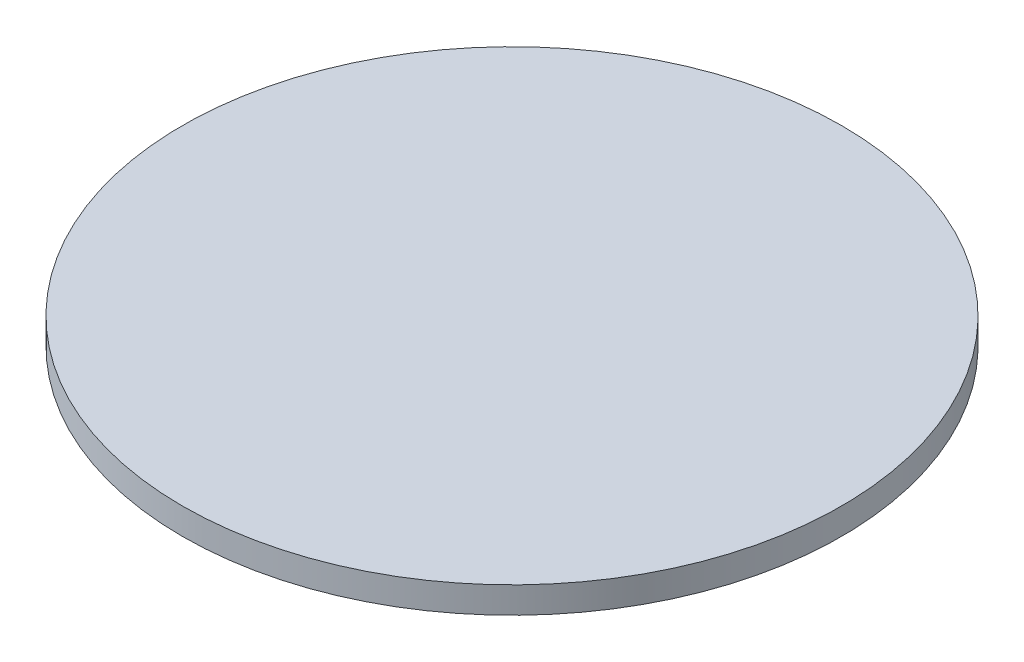
ISO-10303-21;
HEADER;
FILE_DESCRIPTION(('STEP AP214'),'2;1');
FILE_NAME('part.step','',(''),(''),'','','');
FILE_SCHEMA(('AUTOMOTIVE_DESIGN { 1 0 10303 214 1 1 1 1 }'));
ENDSEC;
DATA;
#1=APPLICATION_CONTEXT('core data for automotive mechanical design processes');
#2=APPLICATION_PROTOCOL_DEFINITION('international standard','automotive_design',2000,#1);
#3=PRODUCT_CONTEXT('',#1,'mechanical');
#4=PRODUCT('Part','Part','',(#3));
#5=PRODUCT_RELATED_PRODUCT_CATEGORY('part','',(#4));
#6=PRODUCT_DEFINITION_FORMATION('','',#4);
#7=PRODUCT_DEFINITION_CONTEXT('part definition',#1,'design');
#8=PRODUCT_DEFINITION('design','',#6,#7);
#9=PRODUCT_DEFINITION_SHAPE('','',#8);
#10=(LENGTH_UNIT() NAMED_UNIT(*) SI_UNIT(.MILLI.,.METRE.));
#11=(NAMED_UNIT(*) PLANE_ANGLE_UNIT() SI_UNIT($,.RADIAN.));
#12=(NAMED_UNIT(*) SI_UNIT($,.STERADIAN.) SOLID_ANGLE_UNIT());
#13=UNCERTAINTY_MEASURE_WITH_UNIT(LENGTH_MEASURE(1.E-05),#10,'distance_accuracy_value','');
#14=(GEOMETRIC_REPRESENTATION_CONTEXT(3) GLOBAL_UNCERTAINTY_ASSIGNED_CONTEXT((#13)) GLOBAL_UNIT_ASSIGNED_CONTEXT((#10,
#11,#12)) REPRESENTATION_CONTEXT('',''));
#15=CARTESIAN_POINT('',(0.,0.,0.));
#16=DIRECTION('',(0.,0.,1.));
#17=DIRECTION('',(1.,0.,0.));
#18=AXIS2_PLACEMENT_3D('',#15,#16,#17);
#19=CARTESIAN_POINT('',(0.,2.,0.));
#20=DIRECTION('',(0.,-1.,0.));
#21=DIRECTION('',(0.,0.,-1.));
#22=AXIS2_PLACEMENT_3D('',#19,#20,#21);
#23=CYLINDRICAL_SURFACE('',#22,25.);
#24=CARTESIAN_POINT('',(0.,2.,0.));
#25=DIRECTION('',(0.,1.,0.));
#26=DIRECTION('',(0.,0.,1.));
#27=AXIS2_PLACEMENT_3D('',#24,#25,#26);
#28=CIRCLE('',#27,25.);
#29=CARTESIAN_POINT('',(0.,2.,25.));
#30=VERTEX_POINT('',#29);
#31=EDGE_CURVE('E10',#30,#30,#28,.T.);
#32=ORIENTED_EDGE('',*,*,#31,.F.);
#33=EDGE_LOOP('',(#32));
#34=FACE_BOUND('',#33,.T.);
#35=CARTESIAN_POINT('',(0.,0.,0.));
#36=DIRECTION('',(0.,1.,0.));
#37=DIRECTION('',(0.,0.,1.));
#38=AXIS2_PLACEMENT_3D('',#35,#36,#37);
#39=CIRCLE('',#38,25.);
#40=CARTESIAN_POINT('',(0.,0.,25.));
#41=VERTEX_POINT('',#40);
#42=EDGE_CURVE('E40',#41,#41,#39,.T.);
#43=ORIENTED_EDGE('',*,*,#42,.T.);
#44=EDGE_LOOP('',(#43));
#45=FACE_BOUND('',#44,.T.);
#46=ADVANCED_FACE('F37',(#34,#45),#23,.T.);
#47=CARTESIAN_POINT('',(0.,2.,0.));
#48=DIRECTION('',(0.,1.,0.));
#49=DIRECTION('',(0.,0.,1.));
#50=AXIS2_PLACEMENT_3D('',#47,#48,#49);
#51=PLANE('',#50);
#52=ORIENTED_EDGE('',*,*,#31,.T.);
#53=EDGE_LOOP('',(#52));
#54=FACE_BOUND('',#53,.T.);
#55=ADVANCED_FACE('F52',(#54),#51,.T.);
#56=CARTESIAN_POINT('',(0.,0.,0.));
#57=DIRECTION('',(0.,1.,0.));
#58=DIRECTION('',(0.,0.,1.));
#59=AXIS2_PLACEMENT_3D('',#56,#57,#58);
#60=PLANE('',#59);
#61=ORIENTED_EDGE('',*,*,#42,.F.);
#62=EDGE_LOOP('',(#61));
#63=FACE_BOUND('',#62,.T.);
#64=ADVANCED_FACE('F50',(#63),#60,.F.);
#65=CLOSED_SHELL('',(#46,#55,#64));
#66=MANIFOLD_SOLID_BREP('B2',#65);
#67=ADVANCED_BREP_SHAPE_REPRESENTATION('',(#18,#66),#14);
#68=SHAPE_DEFINITION_REPRESENTATION(#9,#67);
ENDSEC;
END-ISO-10303-21;
